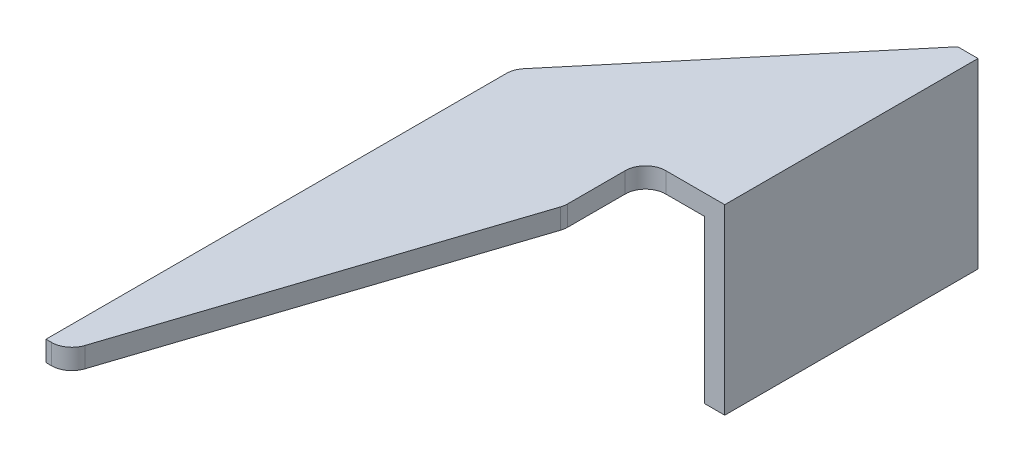
ISO-10303-21;
HEADER;
FILE_DESCRIPTION(('STEP AP214'),'2;1');
FILE_NAME('part.step','',(''),(''),'','','');
FILE_SCHEMA(('AUTOMOTIVE_DESIGN { 1 0 10303 214 1 1 1 1 }'));
ENDSEC;
DATA;
#1=APPLICATION_CONTEXT('core data for automotive mechanical design processes');
#2=APPLICATION_PROTOCOL_DEFINITION('international standard','automotive_design',2000,#1);
#3=PRODUCT_CONTEXT('',#1,'mechanical');
#4=PRODUCT('Part','Part','',(#3));
#5=PRODUCT_RELATED_PRODUCT_CATEGORY('part','',(#4));
#6=PRODUCT_DEFINITION_FORMATION('','',#4);
#7=PRODUCT_DEFINITION_CONTEXT('part definition',#1,'design');
#8=PRODUCT_DEFINITION('design','',#6,#7);
#9=PRODUCT_DEFINITION_SHAPE('','',#8);
#10=(LENGTH_UNIT() NAMED_UNIT(*) SI_UNIT(.MILLI.,.METRE.));
#11=(NAMED_UNIT(*) PLANE_ANGLE_UNIT() SI_UNIT($,.RADIAN.));
#12=(NAMED_UNIT(*) SI_UNIT($,.STERADIAN.) SOLID_ANGLE_UNIT());
#13=UNCERTAINTY_MEASURE_WITH_UNIT(LENGTH_MEASURE(1.E-05),#10,'distance_accuracy_value','');
#14=(GEOMETRIC_REPRESENTATION_CONTEXT(3) GLOBAL_UNCERTAINTY_ASSIGNED_CONTEXT((#13)) GLOBAL_UNIT_ASSIGNED_CONTEXT((#10,
#11,#12)) REPRESENTATION_CONTEXT('',''));
#15=CARTESIAN_POINT('',(0.,0.,0.));
#16=DIRECTION('',(0.,0.,1.));
#17=DIRECTION('',(1.,0.,0.));
#18=AXIS2_PLACEMENT_3D('',#15,#16,#17);
#19=CARTESIAN_POINT('',(0.,18.,70.));
#20=DIRECTION('',(0.,-1.,0.));
#21=DIRECTION('',(1.,0.,0.));
#22=AXIS2_PLACEMENT_3D('',#19,#20,#21);
#23=PLANE('',#22);
#24=DIRECTION('',(0.642787609686544,0.,-0.766044443118974));
#25=VECTOR('',#24,1.);
#26=CARTESIAN_POINT('',(-20.,18.,23.8350718518839));
#27=LINE('',#26,#25);
#28=CARTESIAN_POINT('',(-19.532088886238,18.,23.2774371010432));
#29=VERTEX_POINT('',#28);
#30=CARTESIAN_POINT('',(0.,18.,0.));
#31=VERTEX_POINT('',#30);
#32=EDGE_CURVE('E137',#29,#31,#27,.T.);
#33=ORIENTED_EDGE('',*,*,#32,.F.);
#34=CARTESIAN_POINT('',(-18.,18.,24.5630123204163));
#35=DIRECTION('',(0.,-1.,0.));
#36=DIRECTION('',(1.,0.,0.));
#37=AXIS2_PLACEMENT_3D('',#34,#35,#36);
#38=CIRCLE('',#37,2.);
#39=CARTESIAN_POINT('',(-20.,18.,24.5630123204163));
#40=VERTEX_POINT('',#39);
#41=EDGE_CURVE('E198',#29,#40,#38,.F.);
#42=ORIENTED_EDGE('',*,*,#41,.T.);
#43=DIRECTION('',(0.,0.,-1.));
#44=VECTOR('',#43,1.);
#45=CARTESIAN_POINT('',(-20.,18.,70.));
#46=LINE('',#45,#44);
#47=CARTESIAN_POINT('',(-20.,18.,70.));
#48=VERTEX_POINT('',#47);
#49=EDGE_CURVE('E188',#48,#40,#46,.T.);
#50=ORIENTED_EDGE('',*,*,#49,.F.);
#51=DIRECTION('',(-1.,0.,0.));
#52=VECTOR('',#51,1.);
#53=CARTESIAN_POINT('',(0.,18.,70.));
#54=LINE('',#53,#52);
#55=CARTESIAN_POINT('',(-19.4472747301326,18.,70.));
#56=VERTEX_POINT('',#55);
#57=EDGE_CURVE('E180',#56,#48,#54,.T.);
#58=ORIENTED_EDGE('',*,*,#57,.F.);
#59=CARTESIAN_POINT('',(-19.4472747301326,18.,68.));
#60=DIRECTION('',(0.,-1.,0.));
#61=DIRECTION('',(1.,0.,0.));
#62=AXIS2_PLACEMENT_3D('',#59,#60,#61);
#63=CIRCLE('',#62,2.);
#64=CARTESIAN_POINT('',(-17.547529058948,18.,68.6252730482078));
#65=VERTEX_POINT('',#64);
#66=EDGE_CURVE('E194',#56,#65,#63,.F.);
#67=ORIENTED_EDGE('',*,*,#66,.T.);
#68=DIRECTION('',(-0.312636524103881,0.,0.949872835592346));
#69=VECTOR('',#68,1.);
#70=CARTESIAN_POINT('',(-5.822,18.,33.));
#71=LINE('',#70,#69);
#72=CARTESIAN_POINT('',(-5.92225432881531,18.,33.3045992910303));
#73=VERTEX_POINT('',#72);
#74=EDGE_CURVE('E246',#73,#65,#71,.T.);
#75=ORIENTED_EDGE('',*,*,#74,.F.);
#76=CARTESIAN_POINT('',(-7.822,18.,32.6793262428225));
#77=DIRECTION('',(0.,-1.,0.));
#78=DIRECTION('',(1.,0.,0.));
#79=AXIS2_PLACEMENT_3D('',#76,#77,#78);
#80=CIRCLE('',#79,2.);
#81=CARTESIAN_POINT('',(-5.822,18.,32.6793262428225));
#82=VERTEX_POINT('',#81);
#83=EDGE_CURVE('E196',#73,#82,#80,.F.);
#84=ORIENTED_EDGE('',*,*,#83,.T.);
#85=DIRECTION('',(0.,0.,1.));
#86=VECTOR('',#85,1.);
#87=CARTESIAN_POINT('',(-5.822,18.,25.));
#88=LINE('',#87,#86);
#89=CARTESIAN_POINT('',(-5.822,18.,27.));
#90=VERTEX_POINT('',#89);
#91=EDGE_CURVE('E225',#90,#82,#88,.T.);
#92=ORIENTED_EDGE('',*,*,#91,.F.);
#93=CARTESIAN_POINT('',(-3.822,18.,27.));
#94=DIRECTION('',(0.,-1.,0.));
#95=DIRECTION('',(1.,0.,0.));
#96=AXIS2_PLACEMENT_3D('',#93,#94,#95);
#97=CIRCLE('',#96,2.);
#98=CARTESIAN_POINT('',(-3.822,18.,25.));
#99=VERTEX_POINT('',#98);
#100=EDGE_CURVE('E40',#90,#99,#97,.T.);
#101=ORIENTED_EDGE('',*,*,#100,.T.);
#102=DIRECTION('',(-1.,0.,0.));
#103=VECTOR('',#102,1.);
#104=CARTESIAN_POINT('',(1.99999999999999,18.,25.));
#105=LINE('',#104,#103);
#106=CARTESIAN_POINT('',(1.99999999999999,18.,25.));
#107=VERTEX_POINT('',#106);
#108=EDGE_CURVE('E153',#107,#99,#105,.T.);
#109=ORIENTED_EDGE('',*,*,#108,.F.);
#110=DIRECTION('',(0.,0.,-1.));
#111=VECTOR('',#110,1.);
#112=CARTESIAN_POINT('',(2.,18.,70.));
#113=LINE('',#112,#111);
#114=CARTESIAN_POINT('',(2.,18.,0.));
#115=VERTEX_POINT('',#114);
#116=EDGE_CURVE('E181',#107,#115,#113,.T.);
#117=ORIENTED_EDGE('',*,*,#116,.T.);
#118=DIRECTION('',(-1.,0.,0.));
#119=VECTOR('',#118,1.);
#120=CARTESIAN_POINT('',(0.,18.,0.));
#121=LINE('',#120,#119);
#122=EDGE_CURVE('E170',#115,#31,#121,.T.);
#123=ORIENTED_EDGE('',*,*,#122,.T.);
#124=EDGE_LOOP('',(#33,#42,#50,#58,#67,#75,#84,#92,#101,#109,#117,#123));
#125=FACE_BOUND('',#124,.T.);
#126=ADVANCED_FACE('F32',(#125),#23,.F.);
#127=CARTESIAN_POINT('',(-20.,16.,70.));
#128=DIRECTION('',(-1.,0.,0.));
#129=DIRECTION('',(0.,0.,1.));
#130=AXIS2_PLACEMENT_3D('',#127,#128,#129);
#131=PLANE('',#130);
#132=ORIENTED_EDGE('',*,*,#49,.T.);
#133=DIRECTION('',(0.,1.,0.));
#134=VECTOR('',#133,1.);
#135=CARTESIAN_POINT('',(-20.,16.,24.5630123204163));
#136=LINE('',#135,#134);
#137=CARTESIAN_POINT('',(-20.,16.,24.5630123204163));
#138=VERTEX_POINT('',#137);
#139=EDGE_CURVE('E200',#40,#138,#136,.F.);
#140=ORIENTED_EDGE('',*,*,#139,.T.);
#141=DIRECTION('',(0.,0.,-1.));
#142=VECTOR('',#141,1.);
#143=CARTESIAN_POINT('',(-20.,16.,70.));
#144=LINE('',#143,#142);
#145=CARTESIAN_POINT('',(-20.,16.,70.));
#146=VERTEX_POINT('',#145);
#147=EDGE_CURVE('E163',#146,#138,#144,.T.);
#148=ORIENTED_EDGE('',*,*,#147,.F.);
#149=DIRECTION('',(0.,1.,0.));
#150=VECTOR('',#149,1.);
#151=CARTESIAN_POINT('',(-20.,16.,70.));
#152=LINE('',#151,#150);
#153=EDGE_CURVE('E261',#146,#48,#152,.T.);
#154=ORIENTED_EDGE('',*,*,#153,.T.);
#155=EDGE_LOOP('',(#132,#140,#148,#154));
#156=FACE_BOUND('',#155,.T.);
#157=ADVANCED_FACE('F268',(#156),#131,.T.);
#158=CARTESIAN_POINT('',(0.,16.,70.));
#159=DIRECTION('',(0.,-1.,0.));
#160=DIRECTION('',(1.,0.,0.));
#161=AXIS2_PLACEMENT_3D('',#158,#159,#160);
#162=PLANE('',#161);
#163=ORIENTED_EDGE('',*,*,#147,.T.);
#164=CARTESIAN_POINT('',(-18.,16.,24.5630123204163));
#165=DIRECTION('',(0.,-1.,0.));
#166=DIRECTION('',(1.,0.,0.));
#167=AXIS2_PLACEMENT_3D('',#164,#165,#166);
#168=CIRCLE('',#167,2.);
#169=CARTESIAN_POINT('',(-19.532088886238,16.,23.2774371010432));
#170=VERTEX_POINT('',#169);
#171=EDGE_CURVE('E152',#138,#170,#168,.T.);
#172=ORIENTED_EDGE('',*,*,#171,.T.);
#173=DIRECTION('',(-0.642787609686544,0.,0.766044443118975));
#174=VECTOR('',#173,1.);
#175=CARTESIAN_POINT('',(-34.4682713554274,16.,41.0776862183422));
#176=LINE('',#175,#174);
#177=CARTESIAN_POINT('',(0.,16.,0.));
#178=VERTEX_POINT('',#177);
#179=EDGE_CURVE('E134',#178,#170,#176,.T.);
#180=ORIENTED_EDGE('',*,*,#179,.F.);
#181=DIRECTION('',(0.,0.,-1.));
#182=VECTOR('',#181,1.);
#183=CARTESIAN_POINT('',(0.,16.,70.));
#184=LINE('',#183,#182);
#185=CARTESIAN_POINT('',(0.,16.,25.));
#186=VERTEX_POINT('',#185);
#187=EDGE_CURVE('E150',#186,#178,#184,.T.);
#188=ORIENTED_EDGE('',*,*,#187,.F.);
#189=DIRECTION('',(1.,0.,0.));
#190=VECTOR('',#189,1.);
#191=CARTESIAN_POINT('',(0.,16.,25.));
#192=LINE('',#191,#190);
#193=CARTESIAN_POINT('',(-3.822,16.,25.));
#194=VERTEX_POINT('',#193);
#195=EDGE_CURVE('E174',#194,#186,#192,.T.);
#196=ORIENTED_EDGE('',*,*,#195,.F.);
#197=CARTESIAN_POINT('',(-3.822,16.,27.));
#198=DIRECTION('',(0.,-1.,0.));
#199=DIRECTION('',(1.,0.,0.));
#200=AXIS2_PLACEMENT_3D('',#197,#198,#199);
#201=CIRCLE('',#200,2.);
#202=CARTESIAN_POINT('',(-5.822,16.,27.));
#203=VERTEX_POINT('',#202);
#204=EDGE_CURVE('E11',#194,#203,#201,.F.);
#205=ORIENTED_EDGE('',*,*,#204,.T.);
#206=DIRECTION('',(0.,0.,-1.));
#207=VECTOR('',#206,1.);
#208=CARTESIAN_POINT('',(-5.82199999999999,16.,70.));
#209=LINE('',#208,#207);
#210=CARTESIAN_POINT('',(-5.822,16.,32.6793262428225));
#211=VERTEX_POINT('',#210);
#212=EDGE_CURVE('E143',#211,#203,#209,.T.);
#213=ORIENTED_EDGE('',*,*,#212,.F.);
#214=CARTESIAN_POINT('',(-7.822,16.,32.6793262428225));
#215=DIRECTION('',(0.,-1.,0.));
#216=DIRECTION('',(1.,0.,0.));
#217=AXIS2_PLACEMENT_3D('',#214,#215,#216);
#218=CIRCLE('',#217,2.);
#219=CARTESIAN_POINT('',(-5.92225432881531,16.,33.3045992910303));
#220=VERTEX_POINT('',#219);
#221=EDGE_CURVE('E53',#211,#220,#218,.T.);
#222=ORIENTED_EDGE('',*,*,#221,.T.);
#223=DIRECTION('',(0.312636524103881,0.,-0.949872835592346));
#224=VECTOR('',#223,1.);
#225=CARTESIAN_POINT('',(-16.2406512683324,16.,64.6546310501148));
#226=LINE('',#225,#224);
#227=CARTESIAN_POINT('',(-17.547529058948,16.,68.6252730482078));
#228=VERTEX_POINT('',#227);
#229=EDGE_CURVE('E248',#228,#220,#226,.T.);
#230=ORIENTED_EDGE('',*,*,#229,.F.);
#231=CARTESIAN_POINT('',(-19.4472747301326,16.,68.));
#232=DIRECTION('',(0.,-1.,0.));
#233=DIRECTION('',(1.,0.,0.));
#234=AXIS2_PLACEMENT_3D('',#231,#232,#233);
#235=CIRCLE('',#234,2.);
#236=CARTESIAN_POINT('',(-19.4472747301326,16.,70.));
#237=VERTEX_POINT('',#236);
#238=EDGE_CURVE('E47',#228,#237,#235,.T.);
#239=ORIENTED_EDGE('',*,*,#238,.T.);
#240=DIRECTION('',(-1.,0.,0.));
#241=VECTOR('',#240,1.);
#242=CARTESIAN_POINT('',(0.,16.,70.));
#243=LINE('',#242,#241);
#244=EDGE_CURVE('E184',#237,#146,#243,.T.);
#245=ORIENTED_EDGE('',*,*,#244,.T.);
#246=EDGE_LOOP('',(#163,#172,#180,#188,#196,#205,#213,#222,#230,#239,#245));
#247=FACE_BOUND('',#246,.T.);
#248=ADVANCED_FACE('F148',(#247),#162,.T.);
#249=CARTESIAN_POINT('',(0.,0.,70.));
#250=DIRECTION('',(-1.,0.,0.));
#251=DIRECTION('',(0.,0.,1.));
#252=AXIS2_PLACEMENT_3D('',#249,#250,#251);
#253=PLANE('',#252);
#254=DIRECTION('',(0.,-1.,0.));
#255=VECTOR('',#254,1.);
#256=CARTESIAN_POINT('',(0.,0.,25.));
#257=LINE('',#256,#255);
#258=CARTESIAN_POINT('',(0.,0.,25.));
#259=VERTEX_POINT('',#258);
#260=EDGE_CURVE('E162',#186,#259,#257,.T.);
#261=ORIENTED_EDGE('',*,*,#260,.F.);
#262=ORIENTED_EDGE('',*,*,#187,.T.);
#263=DIRECTION('',(0.,1.,0.));
#264=VECTOR('',#263,1.);
#265=CARTESIAN_POINT('',(0.,0.,0.));
#266=LINE('',#265,#264);
#267=CARTESIAN_POINT('',(0.,0.,0.));
#268=VERTEX_POINT('',#267);
#269=EDGE_CURVE('E160',#268,#178,#266,.T.);
#270=ORIENTED_EDGE('',*,*,#269,.F.);
#271=DIRECTION('',(0.,0.,-1.));
#272=VECTOR('',#271,1.);
#273=CARTESIAN_POINT('',(0.,0.,70.));
#274=LINE('',#273,#272);
#275=EDGE_CURVE('E164',#259,#268,#274,.T.);
#276=ORIENTED_EDGE('',*,*,#275,.F.);
#277=EDGE_LOOP('',(#261,#262,#270,#276));
#278=FACE_BOUND('',#277,.T.);
#279=ADVANCED_FACE('F158',(#278),#253,.T.);
#280=CARTESIAN_POINT('',(2.,0.,70.));
#281=DIRECTION('',(0.,-1.,0.));
#282=DIRECTION('',(0.,0.,-1.));
#283=AXIS2_PLACEMENT_3D('',#280,#281,#282);
#284=PLANE('',#283);
#285=DIRECTION('',(-1.,0.,0.));
#286=VECTOR('',#285,1.);
#287=CARTESIAN_POINT('',(1.99999999999999,0.,25.));
#288=LINE('',#287,#286);
#289=CARTESIAN_POINT('',(1.99999999999999,0.,25.));
#290=VERTEX_POINT('',#289);
#291=EDGE_CURVE('E250',#290,#259,#288,.T.);
#292=ORIENTED_EDGE('',*,*,#291,.T.);
#293=ORIENTED_EDGE('',*,*,#275,.T.);
#294=DIRECTION('',(-1.,0.,0.));
#295=VECTOR('',#294,1.);
#296=CARTESIAN_POINT('',(2.,0.,0.));
#297=LINE('',#296,#295);
#298=CARTESIAN_POINT('',(2.,0.,0.));
#299=VERTEX_POINT('',#298);
#300=EDGE_CURVE('E169',#299,#268,#297,.T.);
#301=ORIENTED_EDGE('',*,*,#300,.F.);
#302=DIRECTION('',(0.,0.,-1.));
#303=VECTOR('',#302,1.);
#304=CARTESIAN_POINT('',(2.,0.,70.));
#305=LINE('',#304,#303);
#306=EDGE_CURVE('E183',#290,#299,#305,.T.);
#307=ORIENTED_EDGE('',*,*,#306,.F.);
#308=EDGE_LOOP('',(#292,#293,#301,#307));
#309=FACE_BOUND('',#308,.T.);
#310=ADVANCED_FACE('F278',(#309),#284,.T.);
#311=CARTESIAN_POINT('',(2.,0.,70.));
#312=DIRECTION('',(-1.,0.,0.));
#313=DIRECTION('',(0.,0.,1.));
#314=AXIS2_PLACEMENT_3D('',#311,#312,#313);
#315=PLANE('',#314);
#316=ORIENTED_EDGE('',*,*,#116,.F.);
#317=DIRECTION('',(0.,1.,0.));
#318=VECTOR('',#317,1.);
#319=CARTESIAN_POINT('',(1.99999999999999,0.,25.));
#320=LINE('',#319,#318);
#321=EDGE_CURVE('E232',#290,#107,#320,.T.);
#322=ORIENTED_EDGE('',*,*,#321,.F.);
#323=ORIENTED_EDGE('',*,*,#306,.T.);
#324=DIRECTION('',(0.,1.,0.));
#325=VECTOR('',#324,1.);
#326=CARTESIAN_POINT('',(2.,0.,0.));
#327=LINE('',#326,#325);
#328=EDGE_CURVE('E172',#299,#115,#327,.T.);
#329=ORIENTED_EDGE('',*,*,#328,.T.);
#330=EDGE_LOOP('',(#316,#322,#323,#329));
#331=FACE_BOUND('',#330,.T.);
#332=ADVANCED_FACE('F279',(#331),#315,.F.);
#333=CARTESIAN_POINT('',(0.,0.,70.));
#334=DIRECTION('',(0.,0.,-1.));
#335=DIRECTION('',(-1.,0.,0.));
#336=AXIS2_PLACEMENT_3D('',#333,#334,#335);
#337=PLANE('',#336);
#338=ORIENTED_EDGE('',*,*,#244,.F.);
#339=DIRECTION('',(0.,1.,0.));
#340=VECTOR('',#339,1.);
#341=CARTESIAN_POINT('',(-19.4472747301326,0.,70.));
#342=LINE('',#341,#340);
#343=EDGE_CURVE('E217',#237,#56,#342,.T.);
#344=ORIENTED_EDGE('',*,*,#343,.T.);
#345=ORIENTED_EDGE('',*,*,#57,.T.);
#346=ORIENTED_EDGE('',*,*,#153,.F.);
#347=EDGE_LOOP('',(#338,#344,#345,#346));
#348=FACE_BOUND('',#347,.T.);
#349=ADVANCED_FACE('F270',(#348),#337,.F.);
#350=CARTESIAN_POINT('',(0.,0.,0.));
#351=DIRECTION('',(0.,0.,-1.));
#352=DIRECTION('',(-1.,0.,0.));
#353=AXIS2_PLACEMENT_3D('',#350,#351,#352);
#354=PLANE('',#353);
#355=DIRECTION('',(0.,-1.,0.));
#356=VECTOR('',#355,1.);
#357=CARTESIAN_POINT('',(0.,0.,0.));
#358=LINE('',#357,#356);
#359=EDGE_CURVE('E130',#31,#178,#358,.T.);
#360=ORIENTED_EDGE('',*,*,#359,.F.);
#361=ORIENTED_EDGE('',*,*,#122,.F.);
#362=ORIENTED_EDGE('',*,*,#328,.F.);
#363=ORIENTED_EDGE('',*,*,#300,.T.);
#364=ORIENTED_EDGE('',*,*,#269,.T.);
#365=EDGE_LOOP('',(#360,#361,#362,#363,#364));
#366=FACE_BOUND('',#365,.T.);
#367=ADVANCED_FACE('F166',(#366),#354,.T.);
#368=CARTESIAN_POINT('',(-5.822,0.,33.));
#369=DIRECTION('',(-0.949872835592346,0.,-0.312636524103881));
#370=DIRECTION('',(-0.312636524103881,0.,0.949872835592346));
#371=AXIS2_PLACEMENT_3D('',#368,#369,#370);
#372=PLANE('',#371);
#373=ORIENTED_EDGE('',*,*,#229,.T.);
#374=DIRECTION('',(0.,1.,0.));
#375=VECTOR('',#374,1.);
#376=CARTESIAN_POINT('',(-5.92225432881531,0.,33.3045992910303));
#377=LINE('',#376,#375);
#378=EDGE_CURVE('E214',#220,#73,#377,.T.);
#379=ORIENTED_EDGE('',*,*,#378,.T.);
#380=ORIENTED_EDGE('',*,*,#74,.T.);
#381=DIRECTION('',(0.,1.,0.));
#382=VECTOR('',#381,1.);
#383=CARTESIAN_POINT('',(-17.547529058948,0.,68.6252730482078));
#384=LINE('',#383,#382);
#385=EDGE_CURVE('E212',#65,#228,#384,.F.);
#386=ORIENTED_EDGE('',*,*,#385,.T.);
#387=EDGE_LOOP('',(#373,#379,#380,#386));
#388=FACE_BOUND('',#387,.T.);
#389=ADVANCED_FACE('F245',(#388),#372,.F.);
#390=CARTESIAN_POINT('',(-5.822,0.,25.));
#391=DIRECTION('',(-1.,0.,0.));
#392=DIRECTION('',(0.,0.,1.));
#393=AXIS2_PLACEMENT_3D('',#390,#391,#392);
#394=PLANE('',#393);
#395=ORIENTED_EDGE('',*,*,#212,.T.);
#396=DIRECTION('',(0.,1.,0.));
#397=VECTOR('',#396,1.);
#398=CARTESIAN_POINT('',(-5.822,18.,27.));
#399=LINE('',#398,#397);
#400=EDGE_CURVE('E207',#203,#90,#399,.T.);
#401=ORIENTED_EDGE('',*,*,#400,.T.);
#402=ORIENTED_EDGE('',*,*,#91,.T.);
#403=DIRECTION('',(0.,1.,0.));
#404=VECTOR('',#403,1.);
#405=CARTESIAN_POINT('',(-5.822,0.,32.6793262428225));
#406=LINE('',#405,#404);
#407=EDGE_CURVE('E205',#82,#211,#406,.F.);
#408=ORIENTED_EDGE('',*,*,#407,.T.);
#409=EDGE_LOOP('',(#395,#401,#402,#408));
#410=FACE_BOUND('',#409,.T.);
#411=ADVANCED_FACE('F237',(#410),#394,.F.);
#412=CARTESIAN_POINT('',(1.99999999999999,0.,25.));
#413=DIRECTION('',(0.,0.,-1.));
#414=DIRECTION('',(-1.,0.,0.));
#415=AXIS2_PLACEMENT_3D('',#412,#413,#414);
#416=PLANE('',#415);
#417=ORIENTED_EDGE('',*,*,#108,.T.);
#418=DIRECTION('',(0.,1.,0.));
#419=VECTOR('',#418,1.);
#420=CARTESIAN_POINT('',(-3.822,16.,25.));
#421=LINE('',#420,#419);
#422=EDGE_CURVE('E210',#99,#194,#421,.F.);
#423=ORIENTED_EDGE('',*,*,#422,.T.);
#424=ORIENTED_EDGE('',*,*,#195,.T.);
#425=ORIENTED_EDGE('',*,*,#260,.T.);
#426=ORIENTED_EDGE('',*,*,#291,.F.);
#427=ORIENTED_EDGE('',*,*,#321,.T.);
#428=EDGE_LOOP('',(#417,#423,#424,#425,#426,#427));
#429=FACE_BOUND('',#428,.T.);
#430=ADVANCED_FACE('F230',(#429),#416,.F.);
#431=CARTESIAN_POINT('',(-20.,0.,23.8350718518839));
#432=DIRECTION('',(0.766044443118974,0.,0.642787609686544));
#433=DIRECTION('',(0.642787609686544,0.,-0.766044443118975));
#434=AXIS2_PLACEMENT_3D('',#431,#432,#433);
#435=PLANE('',#434);
#436=ORIENTED_EDGE('',*,*,#179,.T.);
#437=DIRECTION('',(0.,1.,0.));
#438=VECTOR('',#437,1.);
#439=CARTESIAN_POINT('',(-19.532088886238,18.,23.2774371010432));
#440=LINE('',#439,#438);
#441=EDGE_CURVE('E142',#170,#29,#440,.T.);
#442=ORIENTED_EDGE('',*,*,#441,.T.);
#443=ORIENTED_EDGE('',*,*,#32,.T.);
#444=ORIENTED_EDGE('',*,*,#359,.T.);
#445=EDGE_LOOP('',(#436,#442,#443,#444));
#446=FACE_BOUND('',#445,.T.);
#447=ADVANCED_FACE('F132',(#446),#435,.F.);
#448=CARTESIAN_POINT('',(-18.,0.,24.5630123204163));
#449=DIRECTION('',(0.,-1.,0.));
#450=DIRECTION('',(0.,0.,-1.));
#451=AXIS2_PLACEMENT_3D('',#448,#449,#450);
#452=CYLINDRICAL_SURFACE('',#451,2.);
#453=ORIENTED_EDGE('',*,*,#171,.F.);
#454=ORIENTED_EDGE('',*,*,#139,.F.);
#455=ORIENTED_EDGE('',*,*,#41,.F.);
#456=ORIENTED_EDGE('',*,*,#441,.F.);
#457=EDGE_LOOP('',(#453,#454,#455,#456));
#458=FACE_BOUND('',#457,.T.);
#459=ADVANCED_FACE('F273',(#458),#452,.T.);
#460=CARTESIAN_POINT('',(-3.822,0.,27.));
#461=DIRECTION('',(0.,-1.,0.));
#462=DIRECTION('',(0.,0.,-1.));
#463=AXIS2_PLACEMENT_3D('',#460,#461,#462);
#464=CYLINDRICAL_SURFACE('',#463,2.);
#465=ORIENTED_EDGE('',*,*,#204,.F.);
#466=ORIENTED_EDGE('',*,*,#422,.F.);
#467=ORIENTED_EDGE('',*,*,#100,.F.);
#468=ORIENTED_EDGE('',*,*,#400,.F.);
#469=EDGE_LOOP('',(#465,#466,#467,#468));
#470=FACE_BOUND('',#469,.T.);
#471=ADVANCED_FACE('F235',(#470),#464,.F.);
#472=CARTESIAN_POINT('',(-7.822,0.,32.6793262428225));
#473=DIRECTION('',(0.,1.,0.));
#474=DIRECTION('',(0.,0.,1.));
#475=AXIS2_PLACEMENT_3D('',#472,#473,#474);
#476=CYLINDRICAL_SURFACE('',#475,2.);
#477=ORIENTED_EDGE('',*,*,#221,.F.);
#478=ORIENTED_EDGE('',*,*,#407,.F.);
#479=ORIENTED_EDGE('',*,*,#83,.F.);
#480=ORIENTED_EDGE('',*,*,#378,.F.);
#481=EDGE_LOOP('',(#477,#478,#479,#480));
#482=FACE_BOUND('',#481,.T.);
#483=ADVANCED_FACE('F240',(#482),#476,.T.);
#484=CARTESIAN_POINT('',(-19.4472747301326,0.,68.));
#485=DIRECTION('',(0.,1.,0.));
#486=DIRECTION('',(0.,0.,1.));
#487=AXIS2_PLACEMENT_3D('',#484,#485,#486);
#488=CYLINDRICAL_SURFACE('',#487,2.);
#489=ORIENTED_EDGE('',*,*,#238,.F.);
#490=ORIENTED_EDGE('',*,*,#385,.F.);
#491=ORIENTED_EDGE('',*,*,#66,.F.);
#492=ORIENTED_EDGE('',*,*,#343,.F.);
#493=EDGE_LOOP('',(#489,#490,#491,#492));
#494=FACE_BOUND('',#493,.T.);
#495=ADVANCED_FACE('F34',(#494),#488,.T.);
#496=CLOSED_SHELL('',(#126,#157,#248,#279,#310,#332,#349,#367,#389,#411,#430,#447,#459,#471,
#483,#495));
#497=MANIFOLD_SOLID_BREP('B2',#496);
#498=ADVANCED_BREP_SHAPE_REPRESENTATION('',(#18,#497),#14);
#499=SHAPE_DEFINITION_REPRESENTATION(#9,#498);
ENDSEC;
END-ISO-10303-21;
